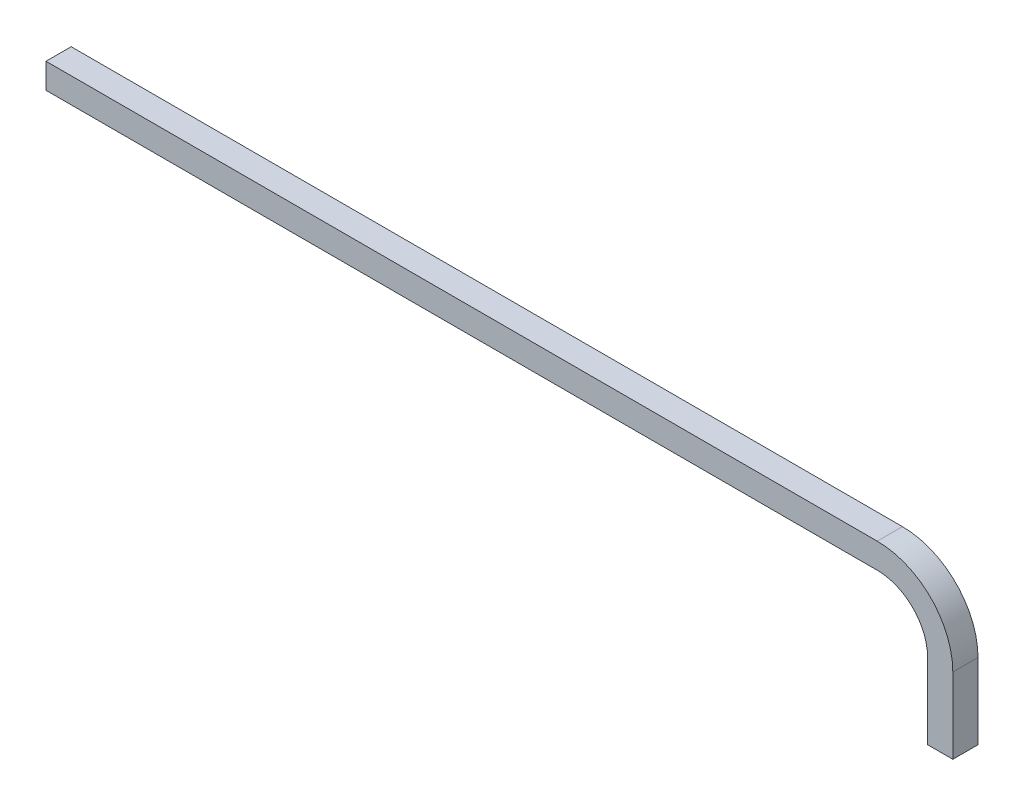
ISO-10303-21;
HEADER;
FILE_DESCRIPTION(('STEP AP214'),'2;1');
FILE_NAME('part.step','',(''),(''),'','','');
FILE_SCHEMA(('AUTOMOTIVE_DESIGN { 1 0 10303 214 1 1 1 1 }'));
ENDSEC;
DATA;
#1=APPLICATION_CONTEXT('core data for automotive mechanical design processes');
#2=APPLICATION_PROTOCOL_DEFINITION('international standard','automotive_design',2000,#1);
#3=PRODUCT_CONTEXT('',#1,'mechanical');
#4=PRODUCT('Part','Part','',(#3));
#5=PRODUCT_RELATED_PRODUCT_CATEGORY('part','',(#4));
#6=PRODUCT_DEFINITION_FORMATION('','',#4);
#7=PRODUCT_DEFINITION_CONTEXT('part definition',#1,'design');
#8=PRODUCT_DEFINITION('design','',#6,#7);
#9=PRODUCT_DEFINITION_SHAPE('','',#8);
#10=(LENGTH_UNIT() NAMED_UNIT(*) SI_UNIT(.MILLI.,.METRE.));
#11=(NAMED_UNIT(*) PLANE_ANGLE_UNIT() SI_UNIT($,.RADIAN.));
#12=(NAMED_UNIT(*) SI_UNIT($,.STERADIAN.) SOLID_ANGLE_UNIT());
#13=UNCERTAINTY_MEASURE_WITH_UNIT(LENGTH_MEASURE(1.E-05),#10,'distance_accuracy_value','');
#14=(GEOMETRIC_REPRESENTATION_CONTEXT(3) GLOBAL_UNCERTAINTY_ASSIGNED_CONTEXT((#13)) GLOBAL_UNIT_ASSIGNED_CONTEXT((#10,
#11,#12)) REPRESENTATION_CONTEXT('',''));
#15=CARTESIAN_POINT('',(0.,0.,0.));
#16=DIRECTION('',(0.,0.,1.));
#17=DIRECTION('',(1.,0.,0.));
#18=AXIS2_PLACEMENT_3D('',#15,#16,#17);
#19=CARTESIAN_POINT('',(-503.628105097736,238.614457831325,25.));
#20=DIRECTION('',(1.,0.,0.));
#21=DIRECTION('',(0.,0.,-1.));
#22=AXIS2_PLACEMENT_3D('',#19,#20,#21);
#23=PLANE('',#22);
#24=DIRECTION('',(0.,-1.,0.));
#25=VECTOR('',#24,1.);
#26=CARTESIAN_POINT('',(-503.628105097736,238.614457831325,0.));
#27=LINE('',#26,#25);
#28=CARTESIAN_POINT('',(-503.628105097736,238.614457831325,0.));
#29=VERTEX_POINT('',#28);
#30=CARTESIAN_POINT('',(-503.628105097736,213.614457831325,0.));
#31=VERTEX_POINT('',#30);
#32=EDGE_CURVE('E203',#29,#31,#27,.T.);
#33=ORIENTED_EDGE('',*,*,#32,.T.);
#34=DIRECTION('',(0.,0.,-1.));
#35=VECTOR('',#34,1.);
#36=CARTESIAN_POINT('',(-503.628105097736,213.614457831325,25.));
#37=LINE('',#36,#35);
#38=CARTESIAN_POINT('',(-503.628105097736,213.614457831325,25.));
#39=VERTEX_POINT('',#38);
#40=EDGE_CURVE('E11',#39,#31,#37,.T.);
#41=ORIENTED_EDGE('',*,*,#40,.F.);
#42=DIRECTION('',(0.,-1.,0.));
#43=VECTOR('',#42,1.);
#44=CARTESIAN_POINT('',(-503.628105097736,238.614457831325,25.));
#45=LINE('',#44,#43);
#46=CARTESIAN_POINT('',(-503.628105097736,238.614457831325,25.));
#47=VERTEX_POINT('',#46);
#48=EDGE_CURVE('E214',#47,#39,#45,.T.);
#49=ORIENTED_EDGE('',*,*,#48,.F.);
#50=DIRECTION('',(0.,0.,-1.));
#51=VECTOR('',#50,1.);
#52=CARTESIAN_POINT('',(-503.628105097736,238.614457831325,25.));
#53=LINE('',#52,#51);
#54=EDGE_CURVE('E232',#47,#29,#53,.T.);
#55=ORIENTED_EDGE('',*,*,#54,.T.);
#56=EDGE_LOOP('',(#33,#41,#49,#55));
#57=FACE_BOUND('',#56,.T.);
#58=DIRECTION('',(0.,-1.,0.));
#59=VECTOR('',#58,1.);
#60=CARTESIAN_POINT('',(-503.628105097736,163.614457831325,2.2));
#61=LINE('',#60,#59);
#62=CARTESIAN_POINT('',(-503.628105097736,236.414457831325,2.2));
#63=VERTEX_POINT('',#62);
#64=CARTESIAN_POINT('',(-503.628105097736,215.814457831325,2.2));
#65=VERTEX_POINT('',#64);
#66=EDGE_CURVE('E153',#63,#65,#61,.T.);
#67=ORIENTED_EDGE('',*,*,#66,.F.);
#68=DIRECTION('',(0.,0.,-1.));
#69=VECTOR('',#68,1.);
#70=CARTESIAN_POINT('',(-503.628105097736,236.414457831325,25.));
#71=LINE('',#70,#69);
#72=CARTESIAN_POINT('',(-503.628105097736,236.414457831325,22.8));
#73=VERTEX_POINT('',#72);
#74=EDGE_CURVE('E188',#73,#63,#71,.T.);
#75=ORIENTED_EDGE('',*,*,#74,.F.);
#76=DIRECTION('',(0.,-1.,0.));
#77=VECTOR('',#76,1.);
#78=CARTESIAN_POINT('',(-503.628105097736,163.614457831325,22.8));
#79=LINE('',#78,#77);
#80=CARTESIAN_POINT('',(-503.628105097736,215.814457831325,22.8));
#81=VERTEX_POINT('',#80);
#82=EDGE_CURVE('E47',#73,#81,#79,.T.);
#83=ORIENTED_EDGE('',*,*,#82,.T.);
#84=DIRECTION('',(0.,0.,-1.));
#85=VECTOR('',#84,1.);
#86=CARTESIAN_POINT('',(-503.628105097736,215.814457831325,25.));
#87=LINE('',#86,#85);
#88=EDGE_CURVE('E164',#81,#65,#87,.T.);
#89=ORIENTED_EDGE('',*,*,#88,.T.);
#90=EDGE_LOOP('',(#67,#75,#83,#89));
#91=FACE_BOUND('',#90,.T.);
#92=ADVANCED_FACE('F33',(#57,#91),#23,.F.);
#93=CARTESIAN_POINT('',(371.371894902264,88.6144578313254,25.));
#94=DIRECTION('',(0.,1.,0.));
#95=DIRECTION('',(0.,0.,1.));
#96=AXIS2_PLACEMENT_3D('',#93,#94,#95);
#97=PLANE('',#96);
#98=DIRECTION('',(1.,0.,0.));
#99=VECTOR('',#98,1.);
#100=CARTESIAN_POINT('',(371.371894902264,88.6144578313254,0.));
#101=LINE('',#100,#99);
#102=CARTESIAN_POINT('',(371.371894902264,88.6144578313254,0.));
#103=VERTEX_POINT('',#102);
#104=CARTESIAN_POINT('',(396.371894902264,88.6144578313254,0.));
#105=VERTEX_POINT('',#104);
#106=EDGE_CURVE('E241',#103,#105,#101,.T.);
#107=ORIENTED_EDGE('',*,*,#106,.T.);
#108=DIRECTION('',(0.,0.,-1.));
#109=VECTOR('',#108,1.);
#110=CARTESIAN_POINT('',(396.371894902264,88.6144578313254,25.));
#111=LINE('',#110,#109);
#112=CARTESIAN_POINT('',(396.371894902264,88.6144578313254,25.));
#113=VERTEX_POINT('',#112);
#114=EDGE_CURVE('E256',#113,#105,#111,.T.);
#115=ORIENTED_EDGE('',*,*,#114,.F.);
#116=DIRECTION('',(1.,0.,0.));
#117=VECTOR('',#116,1.);
#118=CARTESIAN_POINT('',(371.371894902264,88.6144578313254,25.));
#119=LINE('',#118,#117);
#120=CARTESIAN_POINT('',(371.371894902264,88.6144578313254,25.));
#121=VERTEX_POINT('',#120);
#122=EDGE_CURVE('E224',#121,#113,#119,.T.);
#123=ORIENTED_EDGE('',*,*,#122,.F.);
#124=DIRECTION('',(0.,0.,-1.));
#125=VECTOR('',#124,1.);
#126=CARTESIAN_POINT('',(371.371894902264,88.6144578313254,25.));
#127=LINE('',#126,#125);
#128=EDGE_CURVE('E259',#121,#103,#127,.T.);
#129=ORIENTED_EDGE('',*,*,#128,.T.);
#130=EDGE_LOOP('',(#107,#115,#123,#129));
#131=FACE_BOUND('',#130,.T.);
#132=DIRECTION('',(1.,0.,0.));
#133=VECTOR('',#132,1.);
#134=CARTESIAN_POINT('',(321.371894902264,88.6144578313254,2.2));
#135=LINE('',#134,#133);
#136=CARTESIAN_POINT('',(373.571894902264,88.6144578313254,2.2));
#137=VERTEX_POINT('',#136);
#138=CARTESIAN_POINT('',(394.171894902264,88.6144578313254,2.2));
#139=VERTEX_POINT('',#138);
#140=EDGE_CURVE('E172',#137,#139,#135,.T.);
#141=ORIENTED_EDGE('',*,*,#140,.F.);
#142=DIRECTION('',(0.,0.,-1.));
#143=VECTOR('',#142,1.);
#144=CARTESIAN_POINT('',(373.571894902264,88.6144578313254,25.));
#145=LINE('',#144,#143);
#146=CARTESIAN_POINT('',(373.571894902264,88.6144578313254,22.8));
#147=VERTEX_POINT('',#146);
#148=EDGE_CURVE('E177',#147,#137,#145,.T.);
#149=ORIENTED_EDGE('',*,*,#148,.F.);
#150=DIRECTION('',(1.,0.,0.));
#151=VECTOR('',#150,1.);
#152=CARTESIAN_POINT('',(321.371894902264,88.6144578313254,22.8));
#153=LINE('',#152,#151);
#154=CARTESIAN_POINT('',(394.171894902264,88.6144578313254,22.8));
#155=VERTEX_POINT('',#154);
#156=EDGE_CURVE('E54',#147,#155,#153,.T.);
#157=ORIENTED_EDGE('',*,*,#156,.T.);
#158=DIRECTION('',(0.,0.,-1.));
#159=VECTOR('',#158,1.);
#160=CARTESIAN_POINT('',(394.171894902264,88.6144578313254,25.));
#161=LINE('',#160,#159);
#162=EDGE_CURVE('E195',#155,#139,#161,.T.);
#163=ORIENTED_EDGE('',*,*,#162,.T.);
#164=EDGE_LOOP('',(#141,#149,#157,#163));
#165=FACE_BOUND('',#164,.T.);
#166=ADVANCED_FACE('F284',(#131,#165),#97,.F.);
#167=CARTESIAN_POINT('',(-503.628105097736,213.614457831325,25.));
#168=DIRECTION('',(0.,1.,0.));
#169=DIRECTION('',(0.,0.,1.));
#170=AXIS2_PLACEMENT_3D('',#167,#168,#169);
#171=PLANE('',#170);
#172=DIRECTION('',(1.,0.,0.));
#173=VECTOR('',#172,1.);
#174=CARTESIAN_POINT('',(-503.628105097736,213.614457831325,0.));
#175=LINE('',#174,#173);
#176=CARTESIAN_POINT('',(321.371894902263,213.614457831325,0.));
#177=VERTEX_POINT('',#176);
#178=EDGE_CURVE('E235',#31,#177,#175,.T.);
#179=ORIENTED_EDGE('',*,*,#178,.T.);
#180=DIRECTION('',(0.,0.,-1.));
#181=VECTOR('',#180,1.);
#182=CARTESIAN_POINT('',(321.371894902263,213.614457831325,25.));
#183=LINE('',#182,#181);
#184=CARTESIAN_POINT('',(321.371894902263,213.614457831325,25.));
#185=VERTEX_POINT('',#184);
#186=EDGE_CURVE('E40',#185,#177,#183,.T.);
#187=ORIENTED_EDGE('',*,*,#186,.F.);
#188=DIRECTION('',(1.,0.,0.));
#189=VECTOR('',#188,1.);
#190=CARTESIAN_POINT('',(-503.628105097736,213.614457831325,25.));
#191=LINE('',#190,#189);
#192=EDGE_CURVE('E217',#39,#185,#191,.T.);
#193=ORIENTED_EDGE('',*,*,#192,.F.);
#194=ORIENTED_EDGE('',*,*,#40,.T.);
#195=EDGE_LOOP('',(#179,#187,#193,#194));
#196=FACE_BOUND('',#195,.T.);
#197=ADVANCED_FACE('F293',(#196),#171,.F.);
#198=CARTESIAN_POINT('',(321.371894902264,163.614457831325,25.));
#199=DIRECTION('',(0.,0.,-1.));
#200=DIRECTION('',(-1.,0.,0.));
#201=AXIS2_PLACEMENT_3D('',#198,#199,#200);
#202=CYLINDRICAL_SURFACE('',#201,50.);
#203=CARTESIAN_POINT('',(321.371894902264,163.614457831325,0.));
#204=DIRECTION('',(0.,0.,-1.));
#205=DIRECTION('',(-1.,0.,0.));
#206=AXIS2_PLACEMENT_3D('',#203,#204,#205);
#207=CIRCLE('',#206,50.);
#208=CARTESIAN_POINT('',(371.371894902264,163.614457831325,0.));
#209=VERTEX_POINT('',#208);
#210=EDGE_CURVE('E237',#177,#209,#207,.T.);
#211=ORIENTED_EDGE('',*,*,#210,.T.);
#212=DIRECTION('',(0.,0.,-1.));
#213=VECTOR('',#212,1.);
#214=CARTESIAN_POINT('',(371.371894902264,163.614457831325,25.));
#215=LINE('',#214,#213);
#216=CARTESIAN_POINT('',(371.371894902264,163.614457831325,25.));
#217=VERTEX_POINT('',#216);
#218=EDGE_CURVE('E262',#217,#209,#215,.T.);
#219=ORIENTED_EDGE('',*,*,#218,.F.);
#220=CARTESIAN_POINT('',(321.371894902264,163.614457831325,25.));
#221=DIRECTION('',(0.,0.,-1.));
#222=DIRECTION('',(-1.,0.,0.));
#223=AXIS2_PLACEMENT_3D('',#220,#221,#222);
#224=CIRCLE('',#223,50.);
#225=EDGE_CURVE('E220',#185,#217,#224,.T.);
#226=ORIENTED_EDGE('',*,*,#225,.F.);
#227=ORIENTED_EDGE('',*,*,#186,.T.);
#228=EDGE_LOOP('',(#211,#219,#226,#227));
#229=FACE_BOUND('',#228,.T.);
#230=ADVANCED_FACE('F269',(#229),#202,.F.);
#231=CARTESIAN_POINT('',(371.371894902264,163.614457831325,25.));
#232=DIRECTION('',(1.,0.,0.));
#233=DIRECTION('',(0.,1.,0.));
#234=AXIS2_PLACEMENT_3D('',#231,#232,#233);
#235=PLANE('',#234);
#236=DIRECTION('',(0.,-1.,0.));
#237=VECTOR('',#236,1.);
#238=CARTESIAN_POINT('',(371.371894902264,163.614457831325,0.));
#239=LINE('',#238,#237);
#240=EDGE_CURVE('E239',#209,#103,#239,.T.);
#241=ORIENTED_EDGE('',*,*,#240,.T.);
#242=ORIENTED_EDGE('',*,*,#128,.F.);
#243=DIRECTION('',(0.,-1.,0.));
#244=VECTOR('',#243,1.);
#245=CARTESIAN_POINT('',(371.371894902264,163.614457831325,25.));
#246=LINE('',#245,#244);
#247=EDGE_CURVE('E222',#217,#121,#246,.T.);
#248=ORIENTED_EDGE('',*,*,#247,.F.);
#249=ORIENTED_EDGE('',*,*,#218,.T.);
#250=EDGE_LOOP('',(#241,#242,#248,#249));
#251=FACE_BOUND('',#250,.T.);
#252=ADVANCED_FACE('F280',(#251),#235,.F.);
#253=CARTESIAN_POINT('',(396.371894902264,163.614457831325,25.));
#254=DIRECTION('',(-1.,0.,0.));
#255=DIRECTION('',(0.,-1.,0.));
#256=AXIS2_PLACEMENT_3D('',#253,#254,#255);
#257=PLANE('',#256);
#258=DIRECTION('',(0.,1.,0.));
#259=VECTOR('',#258,1.);
#260=CARTESIAN_POINT('',(396.371894902264,163.614457831325,0.));
#261=LINE('',#260,#259);
#262=CARTESIAN_POINT('',(396.371894902264,163.614457831325,0.));
#263=VERTEX_POINT('',#262);
#264=EDGE_CURVE('E243',#105,#263,#261,.T.);
#265=ORIENTED_EDGE('',*,*,#264,.T.);
#266=DIRECTION('',(0.,0.,-1.));
#267=VECTOR('',#266,1.);
#268=CARTESIAN_POINT('',(396.371894902264,163.614457831325,25.));
#269=LINE('',#268,#267);
#270=CARTESIAN_POINT('',(396.371894902264,163.614457831325,25.));
#271=VERTEX_POINT('',#270);
#272=EDGE_CURVE('E253',#271,#263,#269,.T.);
#273=ORIENTED_EDGE('',*,*,#272,.F.);
#274=DIRECTION('',(0.,1.,0.));
#275=VECTOR('',#274,1.);
#276=CARTESIAN_POINT('',(396.371894902264,163.614457831325,25.));
#277=LINE('',#276,#275);
#278=EDGE_CURVE('E226',#113,#271,#277,.T.);
#279=ORIENTED_EDGE('',*,*,#278,.F.);
#280=ORIENTED_EDGE('',*,*,#114,.T.);
#281=EDGE_LOOP('',(#265,#273,#279,#280));
#282=FACE_BOUND('',#281,.T.);
#283=ADVANCED_FACE('F307',(#282),#257,.F.);
#284=CARTESIAN_POINT('',(321.371894902264,163.614457831325,25.));
#285=DIRECTION('',(0.,0.,-1.));
#286=DIRECTION('',(-1.,0.,0.));
#287=AXIS2_PLACEMENT_3D('',#284,#285,#286);
#288=CYLINDRICAL_SURFACE('',#287,75.);
#289=CARTESIAN_POINT('',(321.371894902264,163.614457831325,0.));
#290=DIRECTION('',(0.,0.,1.));
#291=DIRECTION('',(-1.,0.,0.));
#292=AXIS2_PLACEMENT_3D('',#289,#290,#291);
#293=CIRCLE('',#292,75.);
#294=CARTESIAN_POINT('',(321.371894902263,238.614457831325,0.));
#295=VERTEX_POINT('',#294);
#296=EDGE_CURVE('E245',#263,#295,#293,.T.);
#297=ORIENTED_EDGE('',*,*,#296,.T.);
#298=DIRECTION('',(0.,0.,-1.));
#299=VECTOR('',#298,1.);
#300=CARTESIAN_POINT('',(321.371894902263,238.614457831325,25.));
#301=LINE('',#300,#299);
#302=CARTESIAN_POINT('',(321.371894902263,238.614457831325,25.));
#303=VERTEX_POINT('',#302);
#304=EDGE_CURVE('E250',#303,#295,#301,.T.);
#305=ORIENTED_EDGE('',*,*,#304,.F.);
#306=CARTESIAN_POINT('',(321.371894902264,163.614457831325,25.));
#307=DIRECTION('',(0.,0.,1.));
#308=DIRECTION('',(-1.,0.,0.));
#309=AXIS2_PLACEMENT_3D('',#306,#307,#308);
#310=CIRCLE('',#309,75.);
#311=EDGE_CURVE('E228',#271,#303,#310,.T.);
#312=ORIENTED_EDGE('',*,*,#311,.F.);
#313=ORIENTED_EDGE('',*,*,#272,.T.);
#314=EDGE_LOOP('',(#297,#305,#312,#313));
#315=FACE_BOUND('',#314,.T.);
#316=ADVANCED_FACE('F305',(#315),#288,.T.);
#317=CARTESIAN_POINT('',(-503.628105097736,238.614457831325,25.));
#318=DIRECTION('',(0.,-1.,0.));
#319=DIRECTION('',(0.,0.,-1.));
#320=AXIS2_PLACEMENT_3D('',#317,#318,#319);
#321=PLANE('',#320);
#322=DIRECTION('',(-1.,0.,0.));
#323=VECTOR('',#322,1.);
#324=CARTESIAN_POINT('',(-503.628105097736,238.614457831325,0.));
#325=LINE('',#324,#323);
#326=EDGE_CURVE('E218',#295,#29,#325,.T.);
#327=ORIENTED_EDGE('',*,*,#326,.T.);
#328=ORIENTED_EDGE('',*,*,#54,.F.);
#329=DIRECTION('',(-1.,0.,0.));
#330=VECTOR('',#329,1.);
#331=CARTESIAN_POINT('',(-503.628105097736,238.614457831325,25.));
#332=LINE('',#331,#330);
#333=EDGE_CURVE('E230',#303,#47,#332,.T.);
#334=ORIENTED_EDGE('',*,*,#333,.F.);
#335=ORIENTED_EDGE('',*,*,#304,.T.);
#336=EDGE_LOOP('',(#327,#328,#334,#335));
#337=FACE_BOUND('',#336,.T.);
#338=ADVANCED_FACE('F300',(#337),#321,.F.);
#339=CARTESIAN_POINT('',(321.371894902264,163.614457831325,25.));
#340=DIRECTION('',(0.,0.,-1.));
#341=DIRECTION('',(-1.,0.,0.));
#342=AXIS2_PLACEMENT_3D('',#339,#340,#341);
#343=PLANE('',#342);
#344=ORIENTED_EDGE('',*,*,#48,.T.);
#345=ORIENTED_EDGE('',*,*,#192,.T.);
#346=ORIENTED_EDGE('',*,*,#225,.T.);
#347=ORIENTED_EDGE('',*,*,#247,.T.);
#348=ORIENTED_EDGE('',*,*,#122,.T.);
#349=ORIENTED_EDGE('',*,*,#278,.T.);
#350=ORIENTED_EDGE('',*,*,#311,.T.);
#351=ORIENTED_EDGE('',*,*,#333,.T.);
#352=EDGE_LOOP('',(#344,#345,#346,#347,#348,#349,#350,#351));
#353=FACE_BOUND('',#352,.T.);
#354=ADVANCED_FACE('F289',(#353),#343,.F.);
#355=CARTESIAN_POINT('',(321.371894902264,163.614457831325,0.));
#356=DIRECTION('',(0.,0.,-1.));
#357=DIRECTION('',(-1.,0.,0.));
#358=AXIS2_PLACEMENT_3D('',#355,#356,#357);
#359=PLANE('',#358);
#360=ORIENTED_EDGE('',*,*,#32,.F.);
#361=ORIENTED_EDGE('',*,*,#326,.F.);
#362=ORIENTED_EDGE('',*,*,#296,.F.);
#363=ORIENTED_EDGE('',*,*,#264,.F.);
#364=ORIENTED_EDGE('',*,*,#106,.F.);
#365=ORIENTED_EDGE('',*,*,#240,.F.);
#366=ORIENTED_EDGE('',*,*,#210,.F.);
#367=ORIENTED_EDGE('',*,*,#178,.F.);
#368=EDGE_LOOP('',(#360,#361,#362,#363,#364,#365,#366,#367));
#369=FACE_BOUND('',#368,.T.);
#370=ADVANCED_FACE('F275',(#369),#359,.T.);
#371=CARTESIAN_POINT('',(-503.628105097736,215.814457831325,25.));
#372=DIRECTION('',(0.,1.,0.));
#373=DIRECTION('',(0.,0.,1.));
#374=AXIS2_PLACEMENT_3D('',#371,#372,#373);
#375=PLANE('',#374);
#376=DIRECTION('',(1.,0.,0.));
#377=VECTOR('',#376,1.);
#378=CARTESIAN_POINT('',(321.371894902264,215.814457831325,2.2));
#379=LINE('',#378,#377);
#380=CARTESIAN_POINT('',(321.371894902263,215.814457831325,2.2));
#381=VERTEX_POINT('',#380);
#382=EDGE_CURVE('E146',#65,#381,#379,.T.);
#383=ORIENTED_EDGE('',*,*,#382,.F.);
#384=ORIENTED_EDGE('',*,*,#88,.F.);
#385=DIRECTION('',(1.,0.,0.));
#386=VECTOR('',#385,1.);
#387=CARTESIAN_POINT('',(321.371894902264,215.814457831325,22.8));
#388=LINE('',#387,#386);
#389=CARTESIAN_POINT('',(321.371894902263,215.814457831325,22.8));
#390=VERTEX_POINT('',#389);
#391=EDGE_CURVE('E161',#81,#390,#388,.T.);
#392=ORIENTED_EDGE('',*,*,#391,.T.);
#393=DIRECTION('',(0.,0.,-1.));
#394=VECTOR('',#393,1.);
#395=CARTESIAN_POINT('',(321.371894902263,215.814457831325,25.));
#396=LINE('',#395,#394);
#397=EDGE_CURVE('E159',#390,#381,#396,.T.);
#398=ORIENTED_EDGE('',*,*,#397,.T.);
#399=EDGE_LOOP('',(#383,#384,#392,#398));
#400=FACE_BOUND('',#399,.T.);
#401=ADVANCED_FACE('F160',(#400),#375,.T.);
#402=CARTESIAN_POINT('',(321.371894902264,163.614457831325,25.));
#403=DIRECTION('',(0.,0.,-1.));
#404=DIRECTION('',(-1.,0.,0.));
#405=AXIS2_PLACEMENT_3D('',#402,#403,#404);
#406=CYLINDRICAL_SURFACE('',#405,52.2);
#407=CARTESIAN_POINT('',(321.371894902264,163.614457831325,2.2));
#408=DIRECTION('',(0.,0.,-1.));
#409=DIRECTION('',(-1.,0.,0.));
#410=AXIS2_PLACEMENT_3D('',#407,#408,#409);
#411=CIRCLE('',#410,52.2);
#412=CARTESIAN_POINT('',(373.571894902264,163.614457831325,2.2));
#413=VERTEX_POINT('',#412);
#414=EDGE_CURVE('E150',#381,#413,#411,.T.);
#415=ORIENTED_EDGE('',*,*,#414,.F.);
#416=ORIENTED_EDGE('',*,*,#397,.F.);
#417=CARTESIAN_POINT('',(321.371894902264,163.614457831325,22.8));
#418=DIRECTION('',(0.,0.,-1.));
#419=DIRECTION('',(-1.,0.,0.));
#420=AXIS2_PLACEMENT_3D('',#417,#418,#419);
#421=CIRCLE('',#420,52.2);
#422=CARTESIAN_POINT('',(373.571894902264,163.614457831325,22.8));
#423=VERTEX_POINT('',#422);
#424=EDGE_CURVE('E178',#390,#423,#421,.T.);
#425=ORIENTED_EDGE('',*,*,#424,.T.);
#426=DIRECTION('',(0.,0.,1.));
#427=VECTOR('',#426,1.);
#428=CARTESIAN_POINT('',(373.571894902264,163.614457831325,25.));
#429=LINE('',#428,#427);
#430=EDGE_CURVE('E165',#423,#413,#429,.F.);
#431=ORIENTED_EDGE('',*,*,#430,.T.);
#432=EDGE_LOOP('',(#415,#416,#425,#431));
#433=FACE_BOUND('',#432,.T.);
#434=ADVANCED_FACE('F167',(#433),#406,.T.);
#435=CARTESIAN_POINT('',(373.571894902264,163.614457831325,25.));
#436=DIRECTION('',(1.,0.,0.));
#437=DIRECTION('',(0.,1.,0.));
#438=AXIS2_PLACEMENT_3D('',#435,#436,#437);
#439=PLANE('',#438);
#440=DIRECTION('',(0.,-1.,0.));
#441=VECTOR('',#440,1.);
#442=CARTESIAN_POINT('',(373.571894902264,163.614457831325,2.2));
#443=LINE('',#442,#441);
#444=EDGE_CURVE('E170',#413,#137,#443,.T.);
#445=ORIENTED_EDGE('',*,*,#444,.F.);
#446=ORIENTED_EDGE('',*,*,#430,.F.);
#447=DIRECTION('',(0.,-1.,0.));
#448=VECTOR('',#447,1.);
#449=CARTESIAN_POINT('',(373.571894902264,163.614457831325,22.8));
#450=LINE('',#449,#448);
#451=EDGE_CURVE('E179',#423,#147,#450,.T.);
#452=ORIENTED_EDGE('',*,*,#451,.T.);
#453=ORIENTED_EDGE('',*,*,#148,.T.);
#454=EDGE_LOOP('',(#445,#446,#452,#453));
#455=FACE_BOUND('',#454,.T.);
#456=ADVANCED_FACE('F393',(#455),#439,.T.);
#457=CARTESIAN_POINT('',(394.171894902264,163.614457831325,25.));
#458=DIRECTION('',(-1.,0.,0.));
#459=DIRECTION('',(0.,-1.,0.));
#460=AXIS2_PLACEMENT_3D('',#457,#458,#459);
#461=PLANE('',#460);
#462=DIRECTION('',(0.,1.,0.));
#463=VECTOR('',#462,1.);
#464=CARTESIAN_POINT('',(394.171894902264,163.614457831325,2.2));
#465=LINE('',#464,#463);
#466=CARTESIAN_POINT('',(394.171894902264,163.614457831325,2.2));
#467=VERTEX_POINT('',#466);
#468=EDGE_CURVE('E189',#139,#467,#465,.T.);
#469=ORIENTED_EDGE('',*,*,#468,.F.);
#470=ORIENTED_EDGE('',*,*,#162,.F.);
#471=DIRECTION('',(0.,1.,0.));
#472=VECTOR('',#471,1.);
#473=CARTESIAN_POINT('',(394.171894902264,163.614457831325,22.8));
#474=LINE('',#473,#472);
#475=CARTESIAN_POINT('',(394.171894902264,163.614457831325,22.8));
#476=VERTEX_POINT('',#475);
#477=EDGE_CURVE('E182',#155,#476,#474,.T.);
#478=ORIENTED_EDGE('',*,*,#477,.T.);
#479=DIRECTION('',(0.,0.,-1.));
#480=VECTOR('',#479,1.);
#481=CARTESIAN_POINT('',(394.171894902264,163.614457831325,25.));
#482=LINE('',#481,#480);
#483=EDGE_CURVE('E192',#476,#467,#482,.T.);
#484=ORIENTED_EDGE('',*,*,#483,.T.);
#485=EDGE_LOOP('',(#469,#470,#478,#484));
#486=FACE_BOUND('',#485,.T.);
#487=ADVANCED_FACE('F402',(#486),#461,.T.);
#488=CARTESIAN_POINT('',(321.371894902264,163.614457831325,25.));
#489=DIRECTION('',(0.,0.,-1.));
#490=DIRECTION('',(-1.,0.,0.));
#491=AXIS2_PLACEMENT_3D('',#488,#489,#490);
#492=CYLINDRICAL_SURFACE('',#491,72.8);
#493=CARTESIAN_POINT('',(321.371894902264,163.614457831325,2.2));
#494=DIRECTION('',(0.,0.,-1.));
#495=DIRECTION('',(-1.,0.,0.));
#496=AXIS2_PLACEMENT_3D('',#493,#494,#495);
#497=CIRCLE('',#496,72.8);
#498=CARTESIAN_POINT('',(321.371894902263,236.414457831325,2.2));
#499=VERTEX_POINT('',#498);
#500=EDGE_CURVE('E191',#467,#499,#497,.F.);
#501=ORIENTED_EDGE('',*,*,#500,.F.);
#502=ORIENTED_EDGE('',*,*,#483,.F.);
#503=CARTESIAN_POINT('',(321.371894902264,163.614457831325,22.8));
#504=DIRECTION('',(0.,0.,-1.));
#505=DIRECTION('',(-1.,0.,0.));
#506=AXIS2_PLACEMENT_3D('',#503,#504,#505);
#507=CIRCLE('',#506,72.8);
#508=CARTESIAN_POINT('',(321.371894902263,236.414457831325,22.8));
#509=VERTEX_POINT('',#508);
#510=EDGE_CURVE('E184',#476,#509,#507,.F.);
#511=ORIENTED_EDGE('',*,*,#510,.T.);
#512=DIRECTION('',(0.,0.,-1.));
#513=VECTOR('',#512,1.);
#514=CARTESIAN_POINT('',(321.371894902263,236.414457831325,25.));
#515=LINE('',#514,#513);
#516=EDGE_CURVE('E196',#509,#499,#515,.T.);
#517=ORIENTED_EDGE('',*,*,#516,.T.);
#518=EDGE_LOOP('',(#501,#502,#511,#517));
#519=FACE_BOUND('',#518,.T.);
#520=ADVANCED_FACE('F412',(#519),#492,.F.);
#521=CARTESIAN_POINT('',(-503.628105097736,236.414457831325,25.));
#522=DIRECTION('',(0.,-1.,0.));
#523=DIRECTION('',(0.,0.,-1.));
#524=AXIS2_PLACEMENT_3D('',#521,#522,#523);
#525=PLANE('',#524);
#526=DIRECTION('',(-1.,0.,0.));
#527=VECTOR('',#526,1.);
#528=CARTESIAN_POINT('',(321.371894902264,236.414457831325,2.2));
#529=LINE('',#528,#527);
#530=EDGE_CURVE('E198',#499,#63,#529,.T.);
#531=ORIENTED_EDGE('',*,*,#530,.F.);
#532=ORIENTED_EDGE('',*,*,#516,.F.);
#533=DIRECTION('',(-1.,0.,0.));
#534=VECTOR('',#533,1.);
#535=CARTESIAN_POINT('',(321.371894902264,236.414457831325,22.8));
#536=LINE('',#535,#534);
#537=EDGE_CURVE('E186',#509,#73,#536,.T.);
#538=ORIENTED_EDGE('',*,*,#537,.T.);
#539=ORIENTED_EDGE('',*,*,#74,.T.);
#540=EDGE_LOOP('',(#531,#532,#538,#539));
#541=FACE_BOUND('',#540,.T.);
#542=ADVANCED_FACE('F422',(#541),#525,.T.);
#543=CARTESIAN_POINT('',(321.371894902264,163.614457831325,22.8));
#544=DIRECTION('',(0.,0.,-1.));
#545=DIRECTION('',(-1.,0.,0.));
#546=AXIS2_PLACEMENT_3D('',#543,#544,#545);
#547=PLANE('',#546);
#548=ORIENTED_EDGE('',*,*,#82,.F.);
#549=ORIENTED_EDGE('',*,*,#537,.F.);
#550=ORIENTED_EDGE('',*,*,#510,.F.);
#551=ORIENTED_EDGE('',*,*,#477,.F.);
#552=ORIENTED_EDGE('',*,*,#156,.F.);
#553=ORIENTED_EDGE('',*,*,#451,.F.);
#554=ORIENTED_EDGE('',*,*,#424,.F.);
#555=ORIENTED_EDGE('',*,*,#391,.F.);
#556=EDGE_LOOP('',(#548,#549,#550,#551,#552,#553,#554,#555));
#557=FACE_BOUND('',#556,.T.);
#558=ADVANCED_FACE('F432',(#557),#547,.T.);
#559=CARTESIAN_POINT('',(321.371894902264,163.614457831325,2.2));
#560=DIRECTION('',(0.,0.,-1.));
#561=DIRECTION('',(-1.,0.,0.));
#562=AXIS2_PLACEMENT_3D('',#559,#560,#561);
#563=PLANE('',#562);
#564=ORIENTED_EDGE('',*,*,#66,.T.);
#565=ORIENTED_EDGE('',*,*,#382,.T.);
#566=ORIENTED_EDGE('',*,*,#414,.T.);
#567=ORIENTED_EDGE('',*,*,#444,.T.);
#568=ORIENTED_EDGE('',*,*,#140,.T.);
#569=ORIENTED_EDGE('',*,*,#468,.T.);
#570=ORIENTED_EDGE('',*,*,#500,.T.);
#571=ORIENTED_EDGE('',*,*,#530,.T.);
#572=EDGE_LOOP('',(#564,#565,#566,#567,#568,#569,#570,#571));
#573=FACE_BOUND('',#572,.T.);
#574=ADVANCED_FACE('F148',(#573),#563,.F.);
#575=CLOSED_SHELL('',(#92,#166,#197,#230,#252,#283,#316,#338,#354,#370,#401,#434,#456,#487,#520,
#542,#558,#574));
#576=MANIFOLD_SOLID_BREP('B2',#575);
#577=ADVANCED_BREP_SHAPE_REPRESENTATION('',(#18,#576),#14);
#578=SHAPE_DEFINITION_REPRESENTATION(#9,#577);
ENDSEC;
END-ISO-10303-21;
